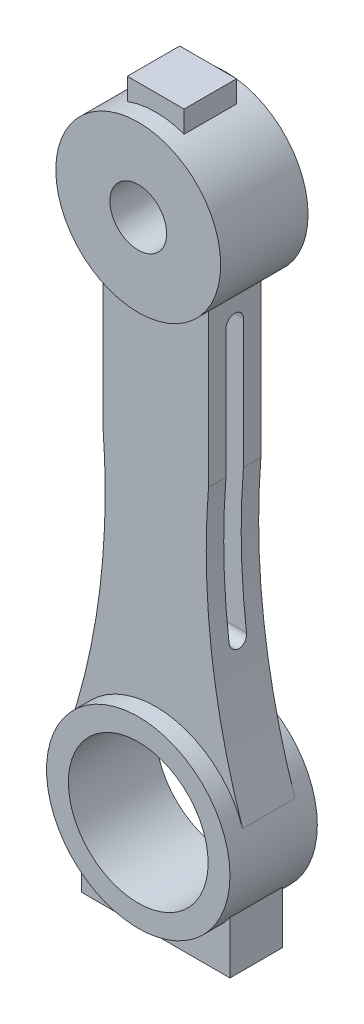
ISO-10303-21;
HEADER;
FILE_DESCRIPTION(('STEP AP214'),'2;1');
FILE_NAME('part.step','',(''),(''),'','','');
FILE_SCHEMA(('AUTOMOTIVE_DESIGN { 1 0 10303 214 1 1 1 1 }'));
ENDSEC;
DATA;
#1=APPLICATION_CONTEXT('core data for automotive mechanical design processes');
#2=APPLICATION_PROTOCOL_DEFINITION('international standard','automotive_design',2000,#1);
#3=PRODUCT_CONTEXT('',#1,'mechanical');
#4=PRODUCT('Part','Part','',(#3));
#5=PRODUCT_RELATED_PRODUCT_CATEGORY('part','',(#4));
#6=PRODUCT_DEFINITION_FORMATION('','',#4);
#7=PRODUCT_DEFINITION_CONTEXT('part definition',#1,'design');
#8=PRODUCT_DEFINITION('design','',#6,#7);
#9=PRODUCT_DEFINITION_SHAPE('','',#8);
#10=(LENGTH_UNIT() NAMED_UNIT(*) SI_UNIT(.MILLI.,.METRE.));
#11=(NAMED_UNIT(*) PLANE_ANGLE_UNIT() SI_UNIT($,.RADIAN.));
#12=(NAMED_UNIT(*) SI_UNIT($,.STERADIAN.) SOLID_ANGLE_UNIT());
#13=UNCERTAINTY_MEASURE_WITH_UNIT(LENGTH_MEASURE(1.E-05),#10,'distance_accuracy_value','');
#14=(GEOMETRIC_REPRESENTATION_CONTEXT(3) GLOBAL_UNCERTAINTY_ASSIGNED_CONTEXT((#13)) GLOBAL_UNIT_ASSIGNED_CONTEXT((#10,
#11,#12)) REPRESENTATION_CONTEXT('',''));
#15=CARTESIAN_POINT('',(0.,0.,0.));
#16=DIRECTION('',(0.,0.,1.));
#17=DIRECTION('',(1.,0.,0.));
#18=AXIS2_PLACEMENT_3D('',#15,#16,#17);
#19=CARTESIAN_POINT('',(171.525621448101,-62.3385849120603,6.));
#20=DIRECTION('',(0.,0.,-1.));
#21=DIRECTION('',(-1.,0.,0.));
#22=AXIS2_PLACEMENT_3D('',#19,#20,#21);
#23=CYLINDRICAL_SURFACE('',#22,159.958297647066);
#24=CARTESIAN_POINT('',(12.7802727197451,-82.,-2.00000000000001));
#25=CARTESIAN_POINT('',(12.7872873414532,-82.0566371139991,-1.99999939400567));
#26=CARTESIAN_POINT('',(12.7943292840255,-82.1132432484063,-1.99759270129749));
#27=CARTESIAN_POINT('',(12.808422755821,-82.2260444921013,-1.98799180149069));
#28=CARTESIAN_POINT('',(12.8154742846555,-82.2822396174989,-1.98079778306532));
#29=CARTESIAN_POINT('',(12.8365567733817,-82.4495350320966,-1.95209830408893));
#30=CARTESIAN_POINT('',(12.8505355662749,-82.5595061994444,-1.9234752615692));
#31=CARTESIAN_POINT('',(12.8779001409659,-82.7730935491784,-1.84802018863842));
#32=CARTESIAN_POINT('',(12.8912856195496,-82.8767064923513,-1.80117896464476));
#33=CARTESIAN_POINT('',(12.9170323970975,-83.0746024326025,-1.69058183530921));
#34=CARTESIAN_POINT('',(12.9293939418516,-83.1688876698105,-1.62683000480176));
#35=CARTESIAN_POINT('',(12.9526447038059,-83.3451536867721,-1.48437492960853));
#36=CARTESIAN_POINT('',(12.9635379615781,-83.4271683054506,-1.40571421204006));
#37=CARTESIAN_POINT('',(12.9835130240159,-83.5768182819943,-1.2355098568575));
#38=CARTESIAN_POINT('',(12.9925946173763,-83.644451962585,-1.14396471857746));
#39=CARTESIAN_POINT('',(13.008549570606,-83.762834333291,-0.951363627936112));
#40=CARTESIAN_POINT('',(13.0154397089814,-83.8137114296629,-0.850387995275236));
#41=CARTESIAN_POINT('',(13.0268516283534,-83.8977769804369,-0.641206380616698));
#42=CARTESIAN_POINT('',(13.0313736785364,-83.9309674453289,-0.533001221994246));
#43=CARTESIAN_POINT('',(13.0378512433228,-83.9784614621124,-0.313383126257495));
#44=CARTESIAN_POINT('',(13.039827567687,-83.9929181571141,-0.20200390512723));
#45=CARTESIAN_POINT('',(13.0412071022917,-84.0030125176839,0.0216208620661234));
#46=CARTESIAN_POINT('',(13.0406103370489,-83.9986503625603,0.133866399864667));
#47=CARTESIAN_POINT('',(13.0368744991897,-83.9712976812293,0.355533997083912));
#48=CARTESIAN_POINT('',(13.0337462213074,-83.9483862516063,0.464966013543431));
#49=CARTESIAN_POINT('',(13.0250785457629,-83.8847193548897,0.678406808177675));
#50=CARTESIAN_POINT('',(13.0195391451696,-83.8439638661038,0.782415579759416));
#51=CARTESIAN_POINT('',(13.0062387701359,-83.7457041164276,0.982317780949797));
#52=CARTESIAN_POINT('',(12.9984730247867,-83.68816388226,1.07819320335089));
#53=CARTESIAN_POINT('',(12.9810041183345,-83.558047589915,1.25892277107229));
#54=CARTESIAN_POINT('',(12.971300987315,-83.4854717652076,1.34377708749308));
#55=CARTESIAN_POINT('',(12.9502183936657,-83.3267951618531,1.50071853901568));
#56=CARTESIAN_POINT('',(12.9388274883789,-83.2406017722705,1.5727104785933));
#57=CARTESIAN_POINT('',(12.9148000977391,-83.0574857036174,1.70124644738217));
#58=CARTESIAN_POINT('',(12.9021631608376,-82.9605591333791,1.7577848481909));
#59=CARTESIAN_POINT('',(12.8759380819939,-82.7578281535156,1.85429852816325));
#60=CARTESIAN_POINT('',(12.8623423609056,-82.6519512814025,1.89411914076092));
#61=CARTESIAN_POINT('',(12.8347356972226,-82.4351431240615,1.95532573401746));
#62=CARTESIAN_POINT('',(12.8207254032024,-82.3242196015561,1.97673908223947));
#63=CARTESIAN_POINT('',(12.8023069085477,-82.1771254709117,1.99245947618217));
#64=CARTESIAN_POINT('',(12.7978868229289,-82.1417293364256,1.99528860685458));
#65=CARTESIAN_POINT('',(12.7890653920062,-82.0708940307434,1.99905631061959));
#66=CARTESIAN_POINT('',(12.7846640277749,-82.0354550284593,1.99999801346112));
#67=CARTESIAN_POINT('',(12.7802727197451,-82.,2.00000000000003));
#68=B_SPLINE_CURVE_WITH_KNOTS('',3,(#24,#25,#26,#27,#28,#29,#30,#31,#32,#33,#34,#35,#36,#37,#38,
#39,#40,#41,#42,#43,#44,#45,#46,#47,#48,#49,#50,#51,#52,#53,#54,#55,#56,#57,#58,#59,#60,#61,#62,
#63,#64,#65,#66,#67),.UNSPECIFIED.,.F.,.F.,(4,2,2,2,2,2,2,2,2,2,2,2,2,2,2,2,2,2,2,2,2,4),(0.,
0.171104435736558,0.342202128476715,0.683917476533051,1.02580549127394,1.36761119829259,
1.70845620237354,2.04934093803694,2.38754915034087,2.72571890934517,3.06110641806035,
3.39649073116875,3.73045240620597,4.06441448722747,4.39909764580796,4.73377560787728,
5.07083627478829,5.40801954098413,5.7482569937137,6.08798770872753,6.19530188632822,
6.30243796692941),.UNSPECIFIED.);
#69=CARTESIAN_POINT('',(12.7802727197451,-82.,-2.00000000000002));
#70=VERTEX_POINT('',#69);
#71=CARTESIAN_POINT('',(12.7802727197451,-82.,2.00000000000003));
#72=VERTEX_POINT('',#71);
#73=EDGE_CURVE('E406',#70,#72,#68,.T.);
#74=ORIENTED_EDGE('',*,*,#73,.T.);
#75=CARTESIAN_POINT('',(171.525621448101,-62.3385849120603,2.00000000000001));
#76=DIRECTION('',(0.,0.,-1.));
#77=DIRECTION('',(0.,1.,0.));
#78=AXIS2_PLACEMENT_3D('',#75,#76,#77);
#79=CIRCLE('',#78,159.958297647066);
#80=CARTESIAN_POINT('',(12.0828581032742,-49.5065077959757,2.00000000000001));
#81=VERTEX_POINT('',#80);
#82=EDGE_CURVE('E259',#72,#81,#79,.T.);
#83=ORIENTED_EDGE('',*,*,#82,.T.);
#84=DIRECTION('',(0.,0.,-1.));
#85=VECTOR('',#84,1.);
#86=CARTESIAN_POINT('',(12.0828581032742,-49.5065077959757,6.));
#87=LINE('',#86,#85);
#88=CARTESIAN_POINT('',(12.0828581032742,-49.5065077959757,6.));
#89=VERTEX_POINT('',#88);
#90=EDGE_CURVE('E371',#89,#81,#87,.T.);
#91=ORIENTED_EDGE('',*,*,#90,.F.);
#92=CARTESIAN_POINT('',(171.525621448101,-62.3385849120603,6.));
#93=DIRECTION('',(0.,0.,1.));
#94=DIRECTION('',(1.,0.,0.));
#95=AXIS2_PLACEMENT_3D('',#92,#93,#94);
#96=CIRCLE('',#95,159.958297647066);
#97=CARTESIAN_POINT('',(19.8882508183088,-113.257783792547,6.));
#98=VERTEX_POINT('',#97);
#99=EDGE_CURVE('E346',#89,#98,#96,.T.);
#100=ORIENTED_EDGE('',*,*,#99,.T.);
#101=DIRECTION('',(0.,0.,-1.));
#102=VECTOR('',#101,1.);
#103=CARTESIAN_POINT('',(19.8882508182896,-113.25778379249,6.));
#104=LINE('',#103,#102);
#105=CARTESIAN_POINT('',(19.8882508183086,-113.257783792547,-6.));
#106=VERTEX_POINT('',#105);
#107=EDGE_CURVE('E374',#98,#106,#104,.T.);
#108=ORIENTED_EDGE('',*,*,#107,.T.);
#109=CARTESIAN_POINT('',(171.525621448101,-62.3385849120603,-6.));
#110=DIRECTION('',(0.,0.,1.));
#111=DIRECTION('',(1.,0.,0.));
#112=AXIS2_PLACEMENT_3D('',#109,#110,#111);
#113=CIRCLE('',#112,159.958297647066);
#114=CARTESIAN_POINT('',(12.0828581032742,-49.5065077959757,-6.));
#115=VERTEX_POINT('',#114);
#116=EDGE_CURVE('E364',#115,#106,#113,.T.);
#117=ORIENTED_EDGE('',*,*,#116,.F.);
#118=CARTESIAN_POINT('',(12.0828581032742,-49.5065077959757,-2.));
#119=VERTEX_POINT('',#118);
#120=EDGE_CURVE('E370',#119,#115,#87,.T.);
#121=ORIENTED_EDGE('',*,*,#120,.F.);
#122=CARTESIAN_POINT('',(171.525621448101,-62.3385849120603,-2.00000000000002));
#123=DIRECTION('',(0.,0.,1.));
#124=DIRECTION('',(0.,-1.,0.));
#125=AXIS2_PLACEMENT_3D('',#122,#123,#124);
#126=CIRCLE('',#125,159.958297647066);
#127=EDGE_CURVE('E64',#119,#70,#126,.T.);
#128=ORIENTED_EDGE('',*,*,#127,.T.);
#129=EDGE_LOOP('',(#74,#83,#91,#100,#108,#117,#121,#128));
#130=FACE_BOUND('',#129,.T.);
#131=ADVANCED_FACE('F41',(#130),#23,.F.);
#132=CARTESIAN_POINT('',(12.0828581032742,0.,6.));
#133=DIRECTION('',(1.,0.,0.));
#134=DIRECTION('',(0.,1.,0.));
#135=AXIS2_PLACEMENT_3D('',#132,#133,#134);
#136=PLANE('',#135);
#137=ORIENTED_EDGE('',*,*,#90,.T.);
#138=DIRECTION('',(0.,1.,0.));
#139=VECTOR('',#138,1.);
#140=CARTESIAN_POINT('',(12.0828581032742,0.,2.));
#141=LINE('',#140,#139);
#142=CARTESIAN_POINT('',(12.0828581032742,-20.,2.));
#143=VERTEX_POINT('',#142);
#144=EDGE_CURVE('E403',#81,#143,#141,.T.);
#145=ORIENTED_EDGE('',*,*,#144,.T.);
#146=CARTESIAN_POINT('',(12.0828581032742,-20.,0.));
#147=DIRECTION('',(1.,0.,0.));
#148=DIRECTION('',(0.,1.,0.));
#149=AXIS2_PLACEMENT_3D('',#146,#147,#148);
#150=CIRCLE('',#149,2.);
#151=CARTESIAN_POINT('',(12.0828581032742,-20.,-2.));
#152=VERTEX_POINT('',#151);
#153=EDGE_CURVE('E400',#143,#152,#150,.F.);
#154=ORIENTED_EDGE('',*,*,#153,.T.);
#155=DIRECTION('',(0.,-1.,0.));
#156=VECTOR('',#155,1.);
#157=CARTESIAN_POINT('',(12.0828581032742,0.,-1.99999999999999));
#158=LINE('',#157,#156);
#159=EDGE_CURVE('E394',#152,#119,#158,.T.);
#160=ORIENTED_EDGE('',*,*,#159,.T.);
#161=ORIENTED_EDGE('',*,*,#120,.T.);
#162=DIRECTION('',(0.,-1.,0.));
#163=VECTOR('',#162,1.);
#164=CARTESIAN_POINT('',(12.0828581032742,0.,-6.));
#165=LINE('',#164,#163);
#166=CARTESIAN_POINT('',(12.0828581032742,-14.5065077959757,-6.));
#167=VERTEX_POINT('',#166);
#168=EDGE_CURVE('E339',#167,#115,#165,.T.);
#169=ORIENTED_EDGE('',*,*,#168,.F.);
#170=DIRECTION('',(0.,0.,-1.));
#171=VECTOR('',#170,1.);
#172=CARTESIAN_POINT('',(12.0828581032742,-14.5065077959757,6.));
#173=LINE('',#172,#171);
#174=CARTESIAN_POINT('',(12.0828581032742,-14.5065077959757,6.));
#175=VERTEX_POINT('',#174);
#176=EDGE_CURVE('E352',#175,#167,#173,.T.);
#177=ORIENTED_EDGE('',*,*,#176,.F.);
#178=DIRECTION('',(0.,-1.,0.));
#179=VECTOR('',#178,1.);
#180=CARTESIAN_POINT('',(12.0828581032742,0.,6.));
#181=LINE('',#180,#179);
#182=EDGE_CURVE('E349',#175,#89,#181,.T.);
#183=ORIENTED_EDGE('',*,*,#182,.T.);
#184=EDGE_LOOP('',(#137,#145,#154,#160,#161,#169,#177,#183));
#185=FACE_BOUND('',#184,.T.);
#186=ADVANCED_FACE('F500',(#185),#136,.T.);
#187=CARTESIAN_POINT('',(0.,0.,10.));
#188=DIRECTION('',(0.,0.,-1.));
#189=DIRECTION('',(-1.,0.,0.));
#190=AXIS2_PLACEMENT_3D('',#187,#188,#189);
#191=CYLINDRICAL_SURFACE('',#190,18.8794657863659);
#192=DIRECTION('',(0.,0.,-1.));
#193=VECTOR('',#192,1.);
#194=CARTESIAN_POINT('',(6.5,17.7252426888481,6.));
#195=LINE('',#194,#193);
#196=CARTESIAN_POINT('',(6.5,17.7252426888481,6.));
#197=VERTEX_POINT('',#196);
#198=CARTESIAN_POINT('',(6.5,17.7252426888481,-6.));
#199=VERTEX_POINT('',#198);
#200=EDGE_CURVE('E320',#197,#199,#195,.T.);
#201=ORIENTED_EDGE('',*,*,#200,.F.);
#202=CARTESIAN_POINT('',(0.,0.,6.));
#203=DIRECTION('',(0.,0.,1.));
#204=DIRECTION('',(1.,0.,0.));
#205=AXIS2_PLACEMENT_3D('',#202,#203,#204);
#206=CIRCLE('',#205,18.8794657863659);
#207=CARTESIAN_POINT('',(-6.5,17.7252426888481,6.));
#208=VERTEX_POINT('',#207);
#209=EDGE_CURVE('E293',#197,#208,#206,.T.);
#210=ORIENTED_EDGE('',*,*,#209,.T.);
#211=DIRECTION('',(0.,0.,-1.));
#212=VECTOR('',#211,1.);
#213=CARTESIAN_POINT('',(-6.5,17.7252426888481,6.));
#214=LINE('',#213,#212);
#215=CARTESIAN_POINT('',(-6.5,17.7252426888481,-6.));
#216=VERTEX_POINT('',#215);
#217=EDGE_CURVE('E304',#208,#216,#214,.T.);
#218=ORIENTED_EDGE('',*,*,#217,.T.);
#219=CARTESIAN_POINT('',(0.,0.,-6.));
#220=DIRECTION('',(0.,0.,1.));
#221=DIRECTION('',(1.,0.,0.));
#222=AXIS2_PLACEMENT_3D('',#219,#220,#221);
#223=CIRCLE('',#222,18.8794657863659);
#224=EDGE_CURVE('E292',#199,#216,#223,.T.);
#225=ORIENTED_EDGE('',*,*,#224,.F.);
#226=EDGE_LOOP('',(#201,#210,#218,#225));
#227=FACE_BOUND('',#226,.T.);
#228=DIRECTION('',(0.,0.,-1.));
#229=VECTOR('',#228,1.);
#230=CARTESIAN_POINT('',(-12.0828581032742,-14.5065077959757,6.));
#231=LINE('',#230,#229);
#232=CARTESIAN_POINT('',(-12.0828581032742,-14.5065077959757,6.));
#233=VERTEX_POINT('',#232);
#234=CARTESIAN_POINT('',(-12.0828581032742,-14.5065077959757,-6.));
#235=VERTEX_POINT('',#234);
#236=EDGE_CURVE('E383',#233,#235,#231,.T.);
#237=ORIENTED_EDGE('',*,*,#236,.F.);
#238=CARTESIAN_POINT('',(0.,0.,6.));
#239=DIRECTION('',(0.,0.,1.));
#240=DIRECTION('',(1.,0.,0.));
#241=AXIS2_PLACEMENT_3D('',#238,#239,#240);
#242=CIRCLE('',#241,18.8794657863659);
#243=EDGE_CURVE('E336',#233,#175,#242,.T.);
#244=ORIENTED_EDGE('',*,*,#243,.T.);
#245=ORIENTED_EDGE('',*,*,#176,.T.);
#246=CARTESIAN_POINT('',(0.,0.,-6.));
#247=DIRECTION('',(0.,0.,1.));
#248=DIRECTION('',(1.,0.,0.));
#249=AXIS2_PLACEMENT_3D('',#246,#247,#248);
#250=CIRCLE('',#249,18.8794657863659);
#251=EDGE_CURVE('E331',#235,#167,#250,.T.);
#252=ORIENTED_EDGE('',*,*,#251,.F.);
#253=EDGE_LOOP('',(#237,#244,#245,#252));
#254=FACE_BOUND('',#253,.T.);
#255=CARTESIAN_POINT('',(0.,0.,10.));
#256=DIRECTION('',(0.,0.,1.));
#257=DIRECTION('',(1.,0.,0.));
#258=AXIS2_PLACEMENT_3D('',#255,#256,#257);
#259=CIRCLE('',#258,18.8794657863659);
#260=CARTESIAN_POINT('',(18.8794657863659,0.,10.));
#261=VERTEX_POINT('',#260);
#262=EDGE_CURVE('E387',#261,#261,#259,.T.);
#263=ORIENTED_EDGE('',*,*,#262,.F.);
#264=EDGE_LOOP('',(#263));
#265=FACE_BOUND('',#264,.T.);
#266=CARTESIAN_POINT('',(0.,0.,-10.));
#267=DIRECTION('',(0.,0.,1.));
#268=DIRECTION('',(1.,0.,0.));
#269=AXIS2_PLACEMENT_3D('',#266,#267,#268);
#270=CIRCLE('',#269,18.8794657863659);
#271=CARTESIAN_POINT('',(18.8794657863659,0.,-10.));
#272=VERTEX_POINT('',#271);
#273=EDGE_CURVE('E386',#272,#272,#270,.T.);
#274=ORIENTED_EDGE('',*,*,#273,.T.);
#275=EDGE_LOOP('',(#274));
#276=FACE_BOUND('',#275,.T.);
#277=ADVANCED_FACE('F43',(#227,#254,#265,#276),#191,.T.);
#278=CARTESIAN_POINT('',(0.,0.,10.));
#279=DIRECTION('',(0.,0.,-1.));
#280=DIRECTION('',(-1.,0.,0.));
#281=AXIS2_PLACEMENT_3D('',#278,#279,#280);
#282=CYLINDRICAL_SURFACE('',#281,6.5);
#283=CARTESIAN_POINT('',(0.,0.,10.));
#284=DIRECTION('',(0.,0.,1.));
#285=DIRECTION('',(1.,0.,0.));
#286=AXIS2_PLACEMENT_3D('',#283,#284,#285);
#287=CIRCLE('',#286,6.5);
#288=CARTESIAN_POINT('',(6.5,0.,10.));
#289=VERTEX_POINT('',#288);
#290=EDGE_CURVE('E390',#289,#289,#287,.T.);
#291=ORIENTED_EDGE('',*,*,#290,.T.);
#292=EDGE_LOOP('',(#291));
#293=FACE_BOUND('',#292,.T.);
#294=CARTESIAN_POINT('',(0.,0.,-10.));
#295=DIRECTION('',(0.,0.,1.));
#296=DIRECTION('',(1.,0.,0.));
#297=AXIS2_PLACEMENT_3D('',#294,#295,#296);
#298=CIRCLE('',#297,6.5);
#299=CARTESIAN_POINT('',(6.5,0.,-10.));
#300=VERTEX_POINT('',#299);
#301=EDGE_CURVE('E391',#300,#300,#298,.T.);
#302=ORIENTED_EDGE('',*,*,#301,.F.);
#303=EDGE_LOOP('',(#302));
#304=FACE_BOUND('',#303,.T.);
#305=ADVANCED_FACE('F507',(#293,#304),#282,.F.);
#306=CARTESIAN_POINT('',(0.,0.,10.));
#307=DIRECTION('',(0.,0.,1.));
#308=DIRECTION('',(1.,0.,0.));
#309=AXIS2_PLACEMENT_3D('',#306,#307,#308);
#310=PLANE('',#309);
#311=ORIENTED_EDGE('',*,*,#262,.T.);
#312=EDGE_LOOP('',(#311));
#313=FACE_BOUND('',#312,.T.);
#314=ORIENTED_EDGE('',*,*,#290,.F.);
#315=EDGE_LOOP('',(#314));
#316=FACE_BOUND('',#315,.T.);
#317=ADVANCED_FACE('F564',(#313,#316),#310,.T.);
#318=CARTESIAN_POINT('',(0.,0.,-10.));
#319=DIRECTION('',(0.,0.,1.));
#320=DIRECTION('',(1.,0.,0.));
#321=AXIS2_PLACEMENT_3D('',#318,#319,#320);
#322=PLANE('',#321);
#323=ORIENTED_EDGE('',*,*,#273,.F.);
#324=EDGE_LOOP('',(#323));
#325=FACE_BOUND('',#324,.T.);
#326=ORIENTED_EDGE('',*,*,#301,.T.);
#327=EDGE_LOOP('',(#326));
#328=FACE_BOUND('',#327,.T.);
#329=ADVANCED_FACE('F562',(#325,#328),#322,.F.);
#330=CARTESIAN_POINT('',(-12.0828581032742,0.,6.));
#331=DIRECTION('',(1.,0.,0.));
#332=DIRECTION('',(0.,1.,0.));
#333=AXIS2_PLACEMENT_3D('',#330,#331,#332);
#334=PLANE('',#333);
#335=DIRECTION('',(0.,0.,-1.));
#336=VECTOR('',#335,1.);
#337=CARTESIAN_POINT('',(-12.0828581032742,-49.5065077959757,6.));
#338=LINE('',#337,#336);
#339=CARTESIAN_POINT('',(-12.0828581032742,-49.5065077959757,-2.00000000000001));
#340=VERTEX_POINT('',#339);
#341=CARTESIAN_POINT('',(-12.0828581032742,-49.5065077959757,-6.));
#342=VERTEX_POINT('',#341);
#343=EDGE_CURVE('E379',#340,#342,#338,.T.);
#344=ORIENTED_EDGE('',*,*,#343,.F.);
#345=DIRECTION('',(0.,1.,0.));
#346=VECTOR('',#345,1.);
#347=CARTESIAN_POINT('',(-12.0828581032742,0.,-1.99999999999999));
#348=LINE('',#347,#346);
#349=CARTESIAN_POINT('',(-12.0828581032742,-20.,-2.));
#350=VERTEX_POINT('',#349);
#351=EDGE_CURVE('E236',#340,#350,#348,.T.);
#352=ORIENTED_EDGE('',*,*,#351,.T.);
#353=CARTESIAN_POINT('',(-12.0828581032742,-20.,0.));
#354=DIRECTION('',(1.,0.,0.));
#355=DIRECTION('',(0.,1.,0.));
#356=AXIS2_PLACEMENT_3D('',#353,#354,#355);
#357=CIRCLE('',#356,2.);
#358=CARTESIAN_POINT('',(-12.0828581032742,-20.,2.));
#359=VERTEX_POINT('',#358);
#360=EDGE_CURVE('E11',#350,#359,#357,.T.);
#361=ORIENTED_EDGE('',*,*,#360,.T.);
#362=DIRECTION('',(0.,-1.,0.));
#363=VECTOR('',#362,1.);
#364=CARTESIAN_POINT('',(-12.0828581032742,0.,2.));
#365=LINE('',#364,#363);
#366=CARTESIAN_POINT('',(-12.0828581032742,-49.5065077959757,2.00000000000001));
#367=VERTEX_POINT('',#366);
#368=EDGE_CURVE('E212',#359,#367,#365,.T.);
#369=ORIENTED_EDGE('',*,*,#368,.T.);
#370=CARTESIAN_POINT('',(-12.0828581032742,-49.5065077959757,6.));
#371=VERTEX_POINT('',#370);
#372=EDGE_CURVE('E380',#371,#367,#338,.T.);
#373=ORIENTED_EDGE('',*,*,#372,.F.);
#374=DIRECTION('',(0.,-1.,0.));
#375=VECTOR('',#374,1.);
#376=CARTESIAN_POINT('',(-12.0828581032742,0.,6.));
#377=LINE('',#376,#375);
#378=EDGE_CURVE('E338',#233,#371,#377,.T.);
#379=ORIENTED_EDGE('',*,*,#378,.F.);
#380=ORIENTED_EDGE('',*,*,#236,.T.);
#381=DIRECTION('',(0.,-1.,0.));
#382=VECTOR('',#381,1.);
#383=CARTESIAN_POINT('',(-12.0828581032742,0.,-6.));
#384=LINE('',#383,#382);
#385=EDGE_CURVE('E355',#235,#342,#384,.T.);
#386=ORIENTED_EDGE('',*,*,#385,.T.);
#387=EDGE_LOOP('',(#344,#352,#361,#369,#373,#379,#380,#386));
#388=FACE_BOUND('',#387,.T.);
#389=ADVANCED_FACE('F558',(#388),#334,.F.);
#390=CARTESIAN_POINT('',(-171.525621448101,-62.3385849120604,6.));
#391=DIRECTION('',(0.,0.,-1.));
#392=DIRECTION('',(-1.,0.,0.));
#393=AXIS2_PLACEMENT_3D('',#390,#391,#392);
#394=CYLINDRICAL_SURFACE('',#393,159.958297647066);
#395=CARTESIAN_POINT('',(-12.7802727197451,-82.,2.00000000000003));
#396=CARTESIAN_POINT('',(-12.7872873414531,-82.0566371139991,1.99999939400569));
#397=CARTESIAN_POINT('',(-12.7943292840254,-82.1132432484064,1.99759270129752));
#398=CARTESIAN_POINT('',(-12.808422755821,-82.2260444921013,1.98799180149071));
#399=CARTESIAN_POINT('',(-12.8154742846555,-82.2822396174989,1.98079778306534));
#400=CARTESIAN_POINT('',(-12.8365567733817,-82.4495350320966,1.95209830408896));
#401=CARTESIAN_POINT('',(-12.8505355662749,-82.5595061994444,1.92347526156923));
#402=CARTESIAN_POINT('',(-12.8779001409659,-82.7730935491784,1.84802018863845));
#403=CARTESIAN_POINT('',(-12.8912856195496,-82.8767064923513,1.80117896464479));
#404=CARTESIAN_POINT('',(-12.9170323970975,-83.0746024326025,1.69058183530923));
#405=CARTESIAN_POINT('',(-12.9293939418515,-83.1688876698105,1.62683000480178));
#406=CARTESIAN_POINT('',(-12.9526447038059,-83.3451536867721,1.48437492960855));
#407=CARTESIAN_POINT('',(-12.963537961578,-83.4271683054506,1.40571421204009));
#408=CARTESIAN_POINT('',(-12.9835130240159,-83.5768182819943,1.23550985685752));
#409=CARTESIAN_POINT('',(-12.9925946173763,-83.644451962585,1.14396471857748));
#410=CARTESIAN_POINT('',(-13.008549570606,-83.762834333291,0.951363627936136));
#411=CARTESIAN_POINT('',(-13.0154397089813,-83.8137114296629,0.850387995275259));
#412=CARTESIAN_POINT('',(-13.0268516283533,-83.8977769804369,0.641206380616721));
#413=CARTESIAN_POINT('',(-13.0313736785364,-83.9309674453289,0.533001221994269));
#414=CARTESIAN_POINT('',(-13.0378512433227,-83.9784614621124,0.313383126257517));
#415=CARTESIAN_POINT('',(-13.039827567687,-83.9929181571141,0.202003905127252));
#416=CARTESIAN_POINT('',(-13.0412071022917,-84.0030125176839,-0.021620862066102));
#417=CARTESIAN_POINT('',(-13.0406103370488,-83.9986503625603,-0.133866399864645));
#418=CARTESIAN_POINT('',(-13.0368744991896,-83.9712976812293,-0.355533997083891));
#419=CARTESIAN_POINT('',(-13.0337462213074,-83.9483862516063,-0.464966013543409));
#420=CARTESIAN_POINT('',(-13.0250785457628,-83.8847193548897,-0.678406808177653));
#421=CARTESIAN_POINT('',(-13.0195391451695,-83.8439638661038,-0.782415579759396));
#422=CARTESIAN_POINT('',(-13.0062387701359,-83.7457041164276,-0.982317780949777));
#423=CARTESIAN_POINT('',(-12.9984730247867,-83.68816388226,-1.07819320335087));
#424=CARTESIAN_POINT('',(-12.9810041183345,-83.558047589915,-1.25892277107227));
#425=CARTESIAN_POINT('',(-12.9713009873149,-83.4854717652076,-1.34377708749306));
#426=CARTESIAN_POINT('',(-12.9502183936657,-83.3267951618531,-1.50071853901566));
#427=CARTESIAN_POINT('',(-12.9388274883789,-83.2406017722705,-1.57271047859328));
#428=CARTESIAN_POINT('',(-12.9148000977391,-83.0574857036174,-1.70124644738214));
#429=CARTESIAN_POINT('',(-12.9021631608375,-82.9605591333791,-1.75778484819088));
#430=CARTESIAN_POINT('',(-12.8759380819938,-82.7578281535156,-1.85429852816323));
#431=CARTESIAN_POINT('',(-12.8623423609056,-82.6519512814025,-1.8941191407609));
#432=CARTESIAN_POINT('',(-12.8347356972226,-82.4351431240615,-1.95532573401744));
#433=CARTESIAN_POINT('',(-12.8207254032024,-82.324219601556,-1.97673908223945));
#434=CARTESIAN_POINT('',(-12.8023069085476,-82.1771254709117,-1.99245947618215));
#435=CARTESIAN_POINT('',(-12.7978868229289,-82.1417293364255,-1.99528860685456));
#436=CARTESIAN_POINT('',(-12.7890653920061,-82.0708940307434,-1.99905631061956));
#437=CARTESIAN_POINT('',(-12.7846640277749,-82.0354550284593,-1.9999980134611));
#438=CARTESIAN_POINT('',(-12.7802727197451,-82.,-2.00000000000001));
#439=B_SPLINE_CURVE_WITH_KNOTS('',3,(#395,#396,#397,#398,#399,#400,#401,#402,#403,#404,#405,
#406,#407,#408,#409,#410,#411,#412,#413,#414,#415,#416,#417,#418,#419,#420,#421,#422,#423,#424,
#425,#426,#427,#428,#429,#430,#431,#432,#433,#434,#435,#436,#437,#438),.UNSPECIFIED.,.F.,.F.,(4,
2,2,2,2,2,2,2,2,2,2,2,2,2,2,2,2,2,2,2,2,4),(0.,0.171104435736572,0.342202128476719,
0.683917476533051,1.02580549127394,1.36761119829259,1.70845620237354,2.04934093803693,
2.38754915034087,2.72571890934517,3.06110641806035,3.39649073116875,3.73045240620597,
4.06441448722747,4.39909764580797,4.73377560787728,5.0708362747883,5.40801954098413,
5.74825699371371,6.08798770872754,6.19530188632824,6.3024379669294),.UNSPECIFIED.);
#440=CARTESIAN_POINT('',(-12.7802727197451,-82.,2.00000000000001));
#441=VERTEX_POINT('',#440);
#442=CARTESIAN_POINT('',(-12.7802727197451,-82.,-2.00000000000002));
#443=VERTEX_POINT('',#442);
#444=EDGE_CURVE('E549',#441,#443,#439,.T.);
#445=ORIENTED_EDGE('',*,*,#444,.T.);
#446=CARTESIAN_POINT('',(-171.525621448101,-62.3385849120604,-2.00000000000002));
#447=DIRECTION('',(0.,0.,-1.));
#448=DIRECTION('',(0.,1.,0.));
#449=AXIS2_PLACEMENT_3D('',#446,#447,#448);
#450=CIRCLE('',#449,159.958297647066);
#451=EDGE_CURVE('E49',#443,#340,#450,.F.);
#452=ORIENTED_EDGE('',*,*,#451,.T.);
#453=ORIENTED_EDGE('',*,*,#343,.T.);
#454=CARTESIAN_POINT('',(-171.525621448101,-62.3385849120604,-6.));
#455=DIRECTION('',(0.,0.,1.));
#456=DIRECTION('',(1.,0.,0.));
#457=AXIS2_PLACEMENT_3D('',#454,#455,#456);
#458=CIRCLE('',#457,159.958297647066);
#459=CARTESIAN_POINT('',(-19.8882508182914,-113.257783792496,-6.));
#460=VERTEX_POINT('',#459);
#461=EDGE_CURVE('E358',#342,#460,#458,.F.);
#462=ORIENTED_EDGE('',*,*,#461,.T.);
#463=DIRECTION('',(0.,0.,-1.));
#464=VECTOR('',#463,1.);
#465=CARTESIAN_POINT('',(-19.8882508182914,-113.257783792496,6.));
#466=LINE('',#465,#464);
#467=CARTESIAN_POINT('',(-19.8882508182879,-113.257783792486,6.));
#468=VERTEX_POINT('',#467);
#469=EDGE_CURVE('E377',#468,#460,#466,.T.);
#470=ORIENTED_EDGE('',*,*,#469,.F.);
#471=CARTESIAN_POINT('',(-171.525621448101,-62.3385849120604,6.));
#472=DIRECTION('',(0.,0.,1.));
#473=DIRECTION('',(1.,0.,0.));
#474=AXIS2_PLACEMENT_3D('',#471,#472,#473);
#475=CIRCLE('',#474,159.958297647066);
#476=EDGE_CURVE('E341',#371,#468,#475,.F.);
#477=ORIENTED_EDGE('',*,*,#476,.F.);
#478=ORIENTED_EDGE('',*,*,#372,.T.);
#479=CARTESIAN_POINT('',(-171.525621448101,-62.3385849120604,2.00000000000001));
#480=DIRECTION('',(0.,0.,1.));
#481=DIRECTION('',(0.,-1.,0.));
#482=AXIS2_PLACEMENT_3D('',#479,#480,#481);
#483=CIRCLE('',#482,159.958297647066);
#484=EDGE_CURVE('E415',#367,#441,#483,.F.);
#485=ORIENTED_EDGE('',*,*,#484,.T.);
#486=EDGE_LOOP('',(#445,#452,#453,#462,#470,#477,#478,#485));
#487=FACE_BOUND('',#486,.T.);
#488=ADVANCED_FACE('F496',(#487),#394,.F.);
#489=CARTESIAN_POINT('',(0.,0.,6.));
#490=DIRECTION('',(0.,0.,1.));
#491=DIRECTION('',(1.,0.,0.));
#492=AXIS2_PLACEMENT_3D('',#489,#490,#491);
#493=PLANE('',#492);
#494=ORIENTED_EDGE('',*,*,#243,.F.);
#495=ORIENTED_EDGE('',*,*,#378,.T.);
#496=ORIENTED_EDGE('',*,*,#476,.T.);
#497=CARTESIAN_POINT('',(0.,-120.,6.));
#498=DIRECTION('',(0.,0.,1.));
#499=DIRECTION('',(1.,0.,0.));
#500=AXIS2_PLACEMENT_3D('',#497,#498,#499);
#501=CIRCLE('',#500,21.);
#502=EDGE_CURVE('E344',#98,#468,#501,.T.);
#503=ORIENTED_EDGE('',*,*,#502,.F.);
#504=ORIENTED_EDGE('',*,*,#99,.F.);
#505=ORIENTED_EDGE('',*,*,#182,.F.);
#506=EDGE_LOOP('',(#494,#495,#496,#503,#504,#505));
#507=FACE_BOUND('',#506,.T.);
#508=ADVANCED_FACE('F493',(#507),#493,.T.);
#509=CARTESIAN_POINT('',(0.,0.,-6.));
#510=DIRECTION('',(0.,0.,1.));
#511=DIRECTION('',(1.,0.,0.));
#512=AXIS2_PLACEMENT_3D('',#509,#510,#511);
#513=PLANE('',#512);
#514=ORIENTED_EDGE('',*,*,#251,.T.);
#515=ORIENTED_EDGE('',*,*,#168,.T.);
#516=ORIENTED_EDGE('',*,*,#116,.T.);
#517=CARTESIAN_POINT('',(0.,-120.,-6.));
#518=DIRECTION('',(0.,0.,1.));
#519=DIRECTION('',(1.,0.,0.));
#520=AXIS2_PLACEMENT_3D('',#517,#518,#519);
#521=CIRCLE('',#520,21.);
#522=EDGE_CURVE('E361',#106,#460,#521,.T.);
#523=ORIENTED_EDGE('',*,*,#522,.T.);
#524=ORIENTED_EDGE('',*,*,#461,.F.);
#525=ORIENTED_EDGE('',*,*,#385,.F.);
#526=EDGE_LOOP('',(#514,#515,#516,#523,#524,#525));
#527=FACE_BOUND('',#526,.T.);
#528=ADVANCED_FACE('F491',(#527),#513,.F.);
#529=CARTESIAN_POINT('',(0.,-120.,10.));
#530=DIRECTION('',(0.,0.,-1.));
#531=DIRECTION('',(-1.,0.,0.));
#532=AXIS2_PLACEMENT_3D('',#529,#530,#531);
#533=CYLINDRICAL_SURFACE('',#532,16.);
#534=CARTESIAN_POINT('',(0.,-120.,10.));
#535=DIRECTION('',(0.,0.,1.));
#536=DIRECTION('',(1.,0.,0.));
#537=AXIS2_PLACEMENT_3D('',#534,#535,#536);
#538=CIRCLE('',#537,16.);
#539=CARTESIAN_POINT('',(16.,-120.,10.));
#540=VERTEX_POINT('',#539);
#541=EDGE_CURVE('E324',#540,#540,#538,.T.);
#542=ORIENTED_EDGE('',*,*,#541,.T.);
#543=EDGE_LOOP('',(#542));
#544=FACE_BOUND('',#543,.T.);
#545=CARTESIAN_POINT('',(0.,-120.,-10.));
#546=DIRECTION('',(0.,0.,1.));
#547=DIRECTION('',(1.,0.,0.));
#548=AXIS2_PLACEMENT_3D('',#545,#546,#547);
#549=CIRCLE('',#548,16.);
#550=CARTESIAN_POINT('',(16.,-120.,-10.));
#551=VERTEX_POINT('',#550);
#552=EDGE_CURVE('E323',#551,#551,#549,.T.);
#553=ORIENTED_EDGE('',*,*,#552,.F.);
#554=EDGE_LOOP('',(#553));
#555=FACE_BOUND('',#554,.T.);
#556=ADVANCED_FACE('F487',(#544,#555),#533,.F.);
#557=CARTESIAN_POINT('',(0.,-120.,10.));
#558=DIRECTION('',(0.,0.,-1.));
#559=DIRECTION('',(-1.,0.,0.));
#560=AXIS2_PLACEMENT_3D('',#557,#558,#559);
#561=CYLINDRICAL_SURFACE('',#560,21.);
#562=DIRECTION('',(0.,0.,-1.));
#563=VECTOR('',#562,1.);
#564=CARTESIAN_POINT('',(-17.,-132.328828005938,6.));
#565=LINE('',#564,#563);
#566=CARTESIAN_POINT('',(-17.,-132.328828005938,6.));
#567=VERTEX_POINT('',#566);
#568=CARTESIAN_POINT('',(-17.,-132.328828005938,-6.));
#569=VERTEX_POINT('',#568);
#570=EDGE_CURVE('E289',#567,#569,#565,.T.);
#571=ORIENTED_EDGE('',*,*,#570,.F.);
#572=CARTESIAN_POINT('',(0.,-120.,6.));
#573=DIRECTION('',(0.,0.,1.));
#574=DIRECTION('',(1.,0.,0.));
#575=AXIS2_PLACEMENT_3D('',#572,#573,#574);
#576=CIRCLE('',#575,21.);
#577=CARTESIAN_POINT('',(17.,-132.328828005938,6.));
#578=VERTEX_POINT('',#577);
#579=EDGE_CURVE('E263',#567,#578,#576,.T.);
#580=ORIENTED_EDGE('',*,*,#579,.T.);
#581=DIRECTION('',(0.,0.,-1.));
#582=VECTOR('',#581,1.);
#583=CARTESIAN_POINT('',(17.,-132.328828005938,6.));
#584=LINE('',#583,#582);
#585=CARTESIAN_POINT('',(17.,-132.328828005938,-6.));
#586=VERTEX_POINT('',#585);
#587=EDGE_CURVE('E273',#578,#586,#584,.T.);
#588=ORIENTED_EDGE('',*,*,#587,.T.);
#589=CARTESIAN_POINT('',(0.,-120.,-6.));
#590=DIRECTION('',(0.,0.,1.));
#591=DIRECTION('',(1.,0.,0.));
#592=AXIS2_PLACEMENT_3D('',#589,#590,#591);
#593=CIRCLE('',#592,21.);
#594=EDGE_CURVE('E262',#569,#586,#593,.T.);
#595=ORIENTED_EDGE('',*,*,#594,.F.);
#596=EDGE_LOOP('',(#571,#580,#588,#595));
#597=FACE_BOUND('',#596,.T.);
#598=ORIENTED_EDGE('',*,*,#502,.T.);
#599=ORIENTED_EDGE('',*,*,#469,.T.);
#600=ORIENTED_EDGE('',*,*,#522,.F.);
#601=ORIENTED_EDGE('',*,*,#107,.F.);
#602=EDGE_LOOP('',(#598,#599,#600,#601));
#603=FACE_BOUND('',#602,.T.);
#604=CARTESIAN_POINT('',(0.,-120.,10.));
#605=DIRECTION('',(0.,0.,1.));
#606=DIRECTION('',(1.,0.,0.));
#607=AXIS2_PLACEMENT_3D('',#604,#605,#606);
#608=CIRCLE('',#607,21.);
#609=CARTESIAN_POINT('',(21.,-120.,10.));
#610=VERTEX_POINT('',#609);
#611=EDGE_CURVE('E327',#610,#610,#608,.T.);
#612=ORIENTED_EDGE('',*,*,#611,.F.);
#613=EDGE_LOOP('',(#612));
#614=FACE_BOUND('',#613,.T.);
#615=CARTESIAN_POINT('',(0.,-120.,-10.));
#616=DIRECTION('',(0.,0.,1.));
#617=DIRECTION('',(1.,0.,0.));
#618=AXIS2_PLACEMENT_3D('',#615,#616,#617);
#619=CIRCLE('',#618,21.);
#620=CARTESIAN_POINT('',(21.,-120.,-10.));
#621=VERTEX_POINT('',#620);
#622=EDGE_CURVE('E328',#621,#621,#619,.T.);
#623=ORIENTED_EDGE('',*,*,#622,.T.);
#624=EDGE_LOOP('',(#623));
#625=FACE_BOUND('',#624,.T.);
#626=ADVANCED_FACE('F480',(#597,#603,#614,#625),#561,.T.);
#627=CARTESIAN_POINT('',(0.,0.,10.));
#628=DIRECTION('',(0.,0.,1.));
#629=DIRECTION('',(1.,0.,0.));
#630=AXIS2_PLACEMENT_3D('',#627,#628,#629);
#631=PLANE('',#630);
#632=ORIENTED_EDGE('',*,*,#541,.F.);
#633=EDGE_LOOP('',(#632));
#634=FACE_BOUND('',#633,.T.);
#635=ORIENTED_EDGE('',*,*,#611,.T.);
#636=EDGE_LOOP('',(#635));
#637=FACE_BOUND('',#636,.T.);
#638=ADVANCED_FACE('F477',(#634,#637),#631,.T.);
#639=CARTESIAN_POINT('',(0.,0.,-10.));
#640=DIRECTION('',(0.,0.,1.));
#641=DIRECTION('',(1.,0.,0.));
#642=AXIS2_PLACEMENT_3D('',#639,#640,#641);
#643=PLANE('',#642);
#644=ORIENTED_EDGE('',*,*,#552,.T.);
#645=EDGE_LOOP('',(#644));
#646=FACE_BOUND('',#645,.T.);
#647=ORIENTED_EDGE('',*,*,#622,.F.);
#648=EDGE_LOOP('',(#647));
#649=FACE_BOUND('',#648,.T.);
#650=ADVANCED_FACE('F475',(#646,#649),#643,.F.);
#651=CARTESIAN_POINT('',(6.49999999999999,0.,6.));
#652=DIRECTION('',(-1.,0.,0.));
#653=DIRECTION('',(0.,-1.,0.));
#654=AXIS2_PLACEMENT_3D('',#651,#652,#653);
#655=PLANE('',#654);
#656=DIRECTION('',(0.,1.,0.));
#657=VECTOR('',#656,1.);
#658=CARTESIAN_POINT('',(6.49999999999999,0.,-6.));
#659=LINE('',#658,#657);
#660=CARTESIAN_POINT('',(6.5,22.7252426888481,-6.));
#661=VERTEX_POINT('',#660);
#662=EDGE_CURVE('E307',#199,#661,#659,.T.);
#663=ORIENTED_EDGE('',*,*,#662,.T.);
#664=DIRECTION('',(0.,0.,-1.));
#665=VECTOR('',#664,1.);
#666=CARTESIAN_POINT('',(6.5,22.7252426888481,6.));
#667=LINE('',#666,#665);
#668=CARTESIAN_POINT('',(6.5,22.7252426888481,6.));
#669=VERTEX_POINT('',#668);
#670=EDGE_CURVE('E318',#669,#661,#667,.T.);
#671=ORIENTED_EDGE('',*,*,#670,.F.);
#672=DIRECTION('',(0.,1.,0.));
#673=VECTOR('',#672,1.);
#674=CARTESIAN_POINT('',(6.49999999999999,0.,6.));
#675=LINE('',#674,#673);
#676=EDGE_CURVE('E295',#197,#669,#675,.T.);
#677=ORIENTED_EDGE('',*,*,#676,.F.);
#678=ORIENTED_EDGE('',*,*,#200,.T.);
#679=EDGE_LOOP('',(#663,#671,#677,#678));
#680=FACE_BOUND('',#679,.T.);
#681=ADVANCED_FACE('F471',(#680),#655,.F.);
#682=CARTESIAN_POINT('',(0.,22.7252426888481,6.));
#683=DIRECTION('',(0.,1.,0.));
#684=DIRECTION('',(0.,0.,1.));
#685=AXIS2_PLACEMENT_3D('',#682,#683,#684);
#686=PLANE('',#685);
#687=DIRECTION('',(1.,0.,0.));
#688=VECTOR('',#687,1.);
#689=CARTESIAN_POINT('',(0.,22.7252426888481,-6.));
#690=LINE('',#689,#688);
#691=CARTESIAN_POINT('',(-6.5,22.7252426888481,-6.));
#692=VERTEX_POINT('',#691);
#693=EDGE_CURVE('E310',#692,#661,#690,.T.);
#694=ORIENTED_EDGE('',*,*,#693,.F.);
#695=DIRECTION('',(0.,0.,-1.));
#696=VECTOR('',#695,1.);
#697=CARTESIAN_POINT('',(-6.5,22.7252426888481,6.));
#698=LINE('',#697,#696);
#699=CARTESIAN_POINT('',(-6.5,22.7252426888481,6.));
#700=VERTEX_POINT('',#699);
#701=EDGE_CURVE('E316',#700,#692,#698,.T.);
#702=ORIENTED_EDGE('',*,*,#701,.F.);
#703=DIRECTION('',(1.,0.,0.));
#704=VECTOR('',#703,1.);
#705=CARTESIAN_POINT('',(0.,22.7252426888481,6.));
#706=LINE('',#705,#704);
#707=EDGE_CURVE('E298',#700,#669,#706,.T.);
#708=ORIENTED_EDGE('',*,*,#707,.T.);
#709=ORIENTED_EDGE('',*,*,#670,.T.);
#710=EDGE_LOOP('',(#694,#702,#708,#709));
#711=FACE_BOUND('',#710,.T.);
#712=ADVANCED_FACE('F467',(#711),#686,.T.);
#713=CARTESIAN_POINT('',(-6.5,0.,6.));
#714=DIRECTION('',(-1.,0.,0.));
#715=DIRECTION('',(0.,-1.,0.));
#716=AXIS2_PLACEMENT_3D('',#713,#714,#715);
#717=PLANE('',#716);
#718=DIRECTION('',(0.,1.,0.));
#719=VECTOR('',#718,1.);
#720=CARTESIAN_POINT('',(-6.5,0.,-6.));
#721=LINE('',#720,#719);
#722=EDGE_CURVE('E296',#216,#692,#721,.T.);
#723=ORIENTED_EDGE('',*,*,#722,.F.);
#724=ORIENTED_EDGE('',*,*,#217,.F.);
#725=DIRECTION('',(0.,1.,0.));
#726=VECTOR('',#725,1.);
#727=CARTESIAN_POINT('',(-6.5,0.,6.));
#728=LINE('',#727,#726);
#729=EDGE_CURVE('E301',#208,#700,#728,.T.);
#730=ORIENTED_EDGE('',*,*,#729,.T.);
#731=ORIENTED_EDGE('',*,*,#701,.T.);
#732=EDGE_LOOP('',(#723,#724,#730,#731));
#733=FACE_BOUND('',#732,.T.);
#734=ADVANCED_FACE('F460',(#733),#717,.T.);
#735=CARTESIAN_POINT('',(0.,0.,6.));
#736=DIRECTION('',(0.,0.,1.));
#737=DIRECTION('',(1.,0.,0.));
#738=AXIS2_PLACEMENT_3D('',#735,#736,#737);
#739=PLANE('',#738);
#740=ORIENTED_EDGE('',*,*,#209,.F.);
#741=ORIENTED_EDGE('',*,*,#676,.T.);
#742=ORIENTED_EDGE('',*,*,#707,.F.);
#743=ORIENTED_EDGE('',*,*,#729,.F.);
#744=EDGE_LOOP('',(#740,#741,#742,#743));
#745=FACE_BOUND('',#744,.T.);
#746=ADVANCED_FACE('F457',(#745),#739,.T.);
#747=CARTESIAN_POINT('',(0.,0.,-6.));
#748=DIRECTION('',(0.,0.,1.));
#749=DIRECTION('',(1.,0.,0.));
#750=AXIS2_PLACEMENT_3D('',#747,#748,#749);
#751=PLANE('',#750);
#752=ORIENTED_EDGE('',*,*,#224,.T.);
#753=ORIENTED_EDGE('',*,*,#722,.T.);
#754=ORIENTED_EDGE('',*,*,#693,.T.);
#755=ORIENTED_EDGE('',*,*,#662,.F.);
#756=EDGE_LOOP('',(#752,#753,#754,#755));
#757=FACE_BOUND('',#756,.T.);
#758=ADVANCED_FACE('F455',(#757),#751,.F.);
#759=CARTESIAN_POINT('',(-17.,0.,6.));
#760=DIRECTION('',(1.,0.,0.));
#761=DIRECTION('',(0.,0.,-1.));
#762=AXIS2_PLACEMENT_3D('',#759,#760,#761);
#763=PLANE('',#762);
#764=DIRECTION('',(0.,-1.,0.));
#765=VECTOR('',#764,1.);
#766=CARTESIAN_POINT('',(-17.,0.,-6.));
#767=LINE('',#766,#765);
#768=CARTESIAN_POINT('',(-17.,-144.328828005938,-6.));
#769=VERTEX_POINT('',#768);
#770=EDGE_CURVE('E276',#569,#769,#767,.T.);
#771=ORIENTED_EDGE('',*,*,#770,.T.);
#772=DIRECTION('',(0.,0.,-1.));
#773=VECTOR('',#772,1.);
#774=CARTESIAN_POINT('',(-17.,-144.328828005938,6.));
#775=LINE('',#774,#773);
#776=CARTESIAN_POINT('',(-17.,-144.328828005938,6.));
#777=VERTEX_POINT('',#776);
#778=EDGE_CURVE('E286',#777,#769,#775,.T.);
#779=ORIENTED_EDGE('',*,*,#778,.F.);
#780=DIRECTION('',(0.,-1.,0.));
#781=VECTOR('',#780,1.);
#782=CARTESIAN_POINT('',(-17.,0.,6.));
#783=LINE('',#782,#781);
#784=EDGE_CURVE('E265',#567,#777,#783,.T.);
#785=ORIENTED_EDGE('',*,*,#784,.F.);
#786=ORIENTED_EDGE('',*,*,#570,.T.);
#787=EDGE_LOOP('',(#771,#779,#785,#786));
#788=FACE_BOUND('',#787,.T.);
#789=ADVANCED_FACE('F451',(#788),#763,.F.);
#790=CARTESIAN_POINT('',(0.,-144.328828005938,6.));
#791=DIRECTION('',(0.,1.,0.));
#792=DIRECTION('',(0.,0.,1.));
#793=AXIS2_PLACEMENT_3D('',#790,#791,#792);
#794=PLANE('',#793);
#795=DIRECTION('',(1.,0.,0.));
#796=VECTOR('',#795,1.);
#797=CARTESIAN_POINT('',(0.,-144.328828005938,-6.));
#798=LINE('',#797,#796);
#799=CARTESIAN_POINT('',(17.,-144.328828005938,-6.));
#800=VERTEX_POINT('',#799);
#801=EDGE_CURVE('E278',#769,#800,#798,.T.);
#802=ORIENTED_EDGE('',*,*,#801,.T.);
#803=DIRECTION('',(0.,0.,-1.));
#804=VECTOR('',#803,1.);
#805=CARTESIAN_POINT('',(17.,-144.328828005938,6.));
#806=LINE('',#805,#804);
#807=CARTESIAN_POINT('',(17.,-144.328828005938,6.));
#808=VERTEX_POINT('',#807);
#809=EDGE_CURVE('E284',#808,#800,#806,.T.);
#810=ORIENTED_EDGE('',*,*,#809,.F.);
#811=DIRECTION('',(1.,0.,0.));
#812=VECTOR('',#811,1.);
#813=CARTESIAN_POINT('',(0.,-144.328828005938,6.));
#814=LINE('',#813,#812);
#815=EDGE_CURVE('E268',#777,#808,#814,.T.);
#816=ORIENTED_EDGE('',*,*,#815,.F.);
#817=ORIENTED_EDGE('',*,*,#778,.T.);
#818=EDGE_LOOP('',(#802,#810,#816,#817));
#819=FACE_BOUND('',#818,.T.);
#820=ADVANCED_FACE('F447',(#819),#794,.F.);
#821=CARTESIAN_POINT('',(17.,0.,6.));
#822=DIRECTION('',(1.,0.,0.));
#823=DIRECTION('',(0.,0.,-1.));
#824=AXIS2_PLACEMENT_3D('',#821,#822,#823);
#825=PLANE('',#824);
#826=DIRECTION('',(0.,-1.,0.));
#827=VECTOR('',#826,1.);
#828=CARTESIAN_POINT('',(17.,0.,-6.));
#829=LINE('',#828,#827);
#830=EDGE_CURVE('E266',#586,#800,#829,.T.);
#831=ORIENTED_EDGE('',*,*,#830,.F.);
#832=ORIENTED_EDGE('',*,*,#587,.F.);
#833=DIRECTION('',(0.,-1.,0.));
#834=VECTOR('',#833,1.);
#835=CARTESIAN_POINT('',(17.,0.,6.));
#836=LINE('',#835,#834);
#837=EDGE_CURVE('E270',#578,#808,#836,.T.);
#838=ORIENTED_EDGE('',*,*,#837,.T.);
#839=ORIENTED_EDGE('',*,*,#809,.T.);
#840=EDGE_LOOP('',(#831,#832,#838,#839));
#841=FACE_BOUND('',#840,.T.);
#842=ADVANCED_FACE('F440',(#841),#825,.T.);
#843=CARTESIAN_POINT('',(0.,0.,6.));
#844=DIRECTION('',(0.,0.,1.));
#845=DIRECTION('',(1.,0.,0.));
#846=AXIS2_PLACEMENT_3D('',#843,#844,#845);
#847=PLANE('',#846);
#848=ORIENTED_EDGE('',*,*,#579,.F.);
#849=ORIENTED_EDGE('',*,*,#784,.T.);
#850=ORIENTED_EDGE('',*,*,#815,.T.);
#851=ORIENTED_EDGE('',*,*,#837,.F.);
#852=EDGE_LOOP('',(#848,#849,#850,#851));
#853=FACE_BOUND('',#852,.T.);
#854=ADVANCED_FACE('F437',(#853),#847,.T.);
#855=CARTESIAN_POINT('',(0.,0.,-6.));
#856=DIRECTION('',(0.,0.,1.));
#857=DIRECTION('',(1.,0.,0.));
#858=AXIS2_PLACEMENT_3D('',#855,#856,#857);
#859=PLANE('',#858);
#860=ORIENTED_EDGE('',*,*,#594,.T.);
#861=ORIENTED_EDGE('',*,*,#830,.T.);
#862=ORIENTED_EDGE('',*,*,#801,.F.);
#863=ORIENTED_EDGE('',*,*,#770,.F.);
#864=EDGE_LOOP('',(#860,#861,#862,#863));
#865=FACE_BOUND('',#864,.T.);
#866=ADVANCED_FACE('F435',(#865),#859,.F.);
#867=CARTESIAN_POINT('',(21.,-20.,0.));
#868=DIRECTION('',(-1.,0.,0.));
#869=DIRECTION('',(0.,0.,1.));
#870=AXIS2_PLACEMENT_3D('',#867,#868,#869);
#871=CYLINDRICAL_SURFACE('',#870,2.);
#872=DIRECTION('',(-1.,0.,0.));
#873=VECTOR('',#872,1.);
#874=CARTESIAN_POINT('',(21.,-20.,2.));
#875=LINE('',#874,#873);
#876=CARTESIAN_POINT('',(6.,-20.,2.));
#877=VERTEX_POINT('',#876);
#878=EDGE_CURVE('E256',#143,#877,#875,.T.);
#879=ORIENTED_EDGE('',*,*,#878,.T.);
#880=CARTESIAN_POINT('',(6.,-20.,0.));
#881=DIRECTION('',(1.,0.,0.));
#882=DIRECTION('',(0.,0.,-1.));
#883=AXIS2_PLACEMENT_3D('',#880,#881,#882);
#884=CIRCLE('',#883,2.);
#885=CARTESIAN_POINT('',(6.,-20.,-2.));
#886=VERTEX_POINT('',#885);
#887=EDGE_CURVE('E238',#886,#877,#884,.T.);
#888=ORIENTED_EDGE('',*,*,#887,.F.);
#889=DIRECTION('',(-1.,0.,0.));
#890=VECTOR('',#889,1.);
#891=CARTESIAN_POINT('',(21.,-20.,-2.));
#892=LINE('',#891,#890);
#893=EDGE_CURVE('E250',#152,#886,#892,.T.);
#894=ORIENTED_EDGE('',*,*,#893,.F.);
#895=ORIENTED_EDGE('',*,*,#153,.F.);
#896=EDGE_LOOP('',(#879,#888,#894,#895));
#897=FACE_BOUND('',#896,.T.);
#898=ADVANCED_FACE('F431',(#897),#871,.F.);
#899=CARTESIAN_POINT('',(21.,-20.,2.));
#900=DIRECTION('',(0.,0.,-1.));
#901=DIRECTION('',(0.,1.,0.));
#902=AXIS2_PLACEMENT_3D('',#899,#900,#901);
#903=PLANE('',#902);
#904=DIRECTION('',(-1.,0.,0.));
#905=VECTOR('',#904,1.);
#906=CARTESIAN_POINT('',(21.,-82.,2.00000000000003));
#907=LINE('',#906,#905);
#908=CARTESIAN_POINT('',(6.,-82.,2.00000000000003));
#909=VERTEX_POINT('',#908);
#910=EDGE_CURVE('E254',#72,#909,#907,.T.);
#911=ORIENTED_EDGE('',*,*,#910,.T.);
#912=DIRECTION('',(0.,-1.,0.));
#913=VECTOR('',#912,1.);
#914=CARTESIAN_POINT('',(6.,-20.,2.));
#915=LINE('',#914,#913);
#916=EDGE_CURVE('E241',#877,#909,#915,.T.);
#917=ORIENTED_EDGE('',*,*,#916,.F.);
#918=ORIENTED_EDGE('',*,*,#878,.F.);
#919=ORIENTED_EDGE('',*,*,#144,.F.);
#920=ORIENTED_EDGE('',*,*,#82,.F.);
#921=EDGE_LOOP('',(#911,#917,#918,#919,#920));
#922=FACE_BOUND('',#921,.T.);
#923=ADVANCED_FACE('F426',(#922),#903,.T.);
#924=CARTESIAN_POINT('',(21.,-82.,0.));
#925=DIRECTION('',(-1.,0.,0.));
#926=DIRECTION('',(0.,0.,1.));
#927=AXIS2_PLACEMENT_3D('',#924,#925,#926);
#928=CYLINDRICAL_SURFACE('',#927,2.00000000000002);
#929=DIRECTION('',(-1.,0.,0.));
#930=VECTOR('',#929,1.);
#931=CARTESIAN_POINT('',(21.,-82.,-2.00000000000002));
#932=LINE('',#931,#930);
#933=CARTESIAN_POINT('',(6.,-82.,-2.00000000000002));
#934=VERTEX_POINT('',#933);
#935=EDGE_CURVE('E252',#70,#934,#932,.T.);
#936=ORIENTED_EDGE('',*,*,#935,.T.);
#937=CARTESIAN_POINT('',(6.,-82.,0.));
#938=DIRECTION('',(1.,0.,0.));
#939=DIRECTION('',(0.,0.,-1.));
#940=AXIS2_PLACEMENT_3D('',#937,#938,#939);
#941=CIRCLE('',#940,2.00000000000002);
#942=EDGE_CURVE('E244',#909,#934,#941,.T.);
#943=ORIENTED_EDGE('',*,*,#942,.F.);
#944=ORIENTED_EDGE('',*,*,#910,.F.);
#945=ORIENTED_EDGE('',*,*,#73,.F.);
#946=EDGE_LOOP('',(#936,#943,#944,#945));
#947=FACE_BOUND('',#946,.T.);
#948=ADVANCED_FACE('F420',(#947),#928,.F.);
#949=CARTESIAN_POINT('',(21.,-20.,-2.));
#950=DIRECTION('',(0.,0.,1.));
#951=DIRECTION('',(0.,-1.,0.));
#952=AXIS2_PLACEMENT_3D('',#949,#950,#951);
#953=PLANE('',#952);
#954=ORIENTED_EDGE('',*,*,#159,.F.);
#955=ORIENTED_EDGE('',*,*,#893,.T.);
#956=DIRECTION('',(0.,1.,0.));
#957=VECTOR('',#956,1.);
#958=CARTESIAN_POINT('',(6.,-20.,-2.));
#959=LINE('',#958,#957);
#960=EDGE_CURVE('E247',#934,#886,#959,.T.);
#961=ORIENTED_EDGE('',*,*,#960,.F.);
#962=ORIENTED_EDGE('',*,*,#935,.F.);
#963=ORIENTED_EDGE('',*,*,#127,.F.);
#964=EDGE_LOOP('',(#954,#955,#961,#962,#963));
#965=FACE_BOUND('',#964,.T.);
#966=ADVANCED_FACE('F425',(#965),#953,.T.);
#967=CARTESIAN_POINT('',(6.,-20.,0.));
#968=DIRECTION('',(1.,0.,0.));
#969=DIRECTION('',(0.,0.,-1.));
#970=AXIS2_PLACEMENT_3D('',#967,#968,#969);
#971=PLANE('',#970);
#972=ORIENTED_EDGE('',*,*,#887,.T.);
#973=ORIENTED_EDGE('',*,*,#916,.T.);
#974=ORIENTED_EDGE('',*,*,#942,.T.);
#975=ORIENTED_EDGE('',*,*,#960,.T.);
#976=EDGE_LOOP('',(#972,#973,#974,#975));
#977=FACE_BOUND('',#976,.T.);
#978=ADVANCED_FACE('F530',(#977),#971,.T.);
#979=CARTESIAN_POINT('',(-21.,-20.,0.));
#980=DIRECTION('',(1.,0.,0.));
#981=DIRECTION('',(0.,0.,-1.));
#982=AXIS2_PLACEMENT_3D('',#979,#980,#981);
#983=CYLINDRICAL_SURFACE('',#982,2.);
#984=DIRECTION('',(1.,0.,0.));
#985=VECTOR('',#984,1.);
#986=CARTESIAN_POINT('',(-21.,-20.,-2.));
#987=LINE('',#986,#985);
#988=CARTESIAN_POINT('',(-6.,-20.,-2.));
#989=VERTEX_POINT('',#988);
#990=EDGE_CURVE('E203',#350,#989,#987,.T.);
#991=ORIENTED_EDGE('',*,*,#990,.T.);
#992=CARTESIAN_POINT('',(-6.,-20.,0.));
#993=DIRECTION('',(1.,0.,0.));
#994=DIRECTION('',(0.,0.,-1.));
#995=AXIS2_PLACEMENT_3D('',#992,#993,#994);
#996=CIRCLE('',#995,2.);
#997=CARTESIAN_POINT('',(-6.,-20.,2.));
#998=VERTEX_POINT('',#997);
#999=EDGE_CURVE('E207',#989,#998,#996,.T.);
#1000=ORIENTED_EDGE('',*,*,#999,.T.);
#1001=DIRECTION('',(1.,0.,0.));
#1002=VECTOR('',#1001,1.);
#1003=CARTESIAN_POINT('',(-21.,-20.,2.));
#1004=LINE('',#1003,#1002);
#1005=EDGE_CURVE('E230',#359,#998,#1004,.T.);
#1006=ORIENTED_EDGE('',*,*,#1005,.F.);
#1007=ORIENTED_EDGE('',*,*,#360,.F.);
#1008=EDGE_LOOP('',(#991,#1000,#1006,#1007));
#1009=FACE_BOUND('',#1008,.T.);
#1010=ADVANCED_FACE('F205',(#1009),#983,.F.);
#1011=CARTESIAN_POINT('',(-21.,-20.,-2.));
#1012=DIRECTION('',(0.,0.,-1.));
#1013=DIRECTION('',(0.,1.,0.));
#1014=AXIS2_PLACEMENT_3D('',#1011,#1012,#1013);
#1015=PLANE('',#1014);
#1016=ORIENTED_EDGE('',*,*,#451,.F.);
#1017=DIRECTION('',(1.,0.,0.));
#1018=VECTOR('',#1017,1.);
#1019=CARTESIAN_POINT('',(-21.,-82.,-2.00000000000002));
#1020=LINE('',#1019,#1018);
#1021=CARTESIAN_POINT('',(-6.,-82.,-2.00000000000002));
#1022=VERTEX_POINT('',#1021);
#1023=EDGE_CURVE('E213',#443,#1022,#1020,.T.);
#1024=ORIENTED_EDGE('',*,*,#1023,.T.);
#1025=DIRECTION('',(0.,1.,0.));
#1026=VECTOR('',#1025,1.);
#1027=CARTESIAN_POINT('',(-6.,-20.,-2.));
#1028=LINE('',#1027,#1026);
#1029=EDGE_CURVE('E219',#1022,#989,#1028,.T.);
#1030=ORIENTED_EDGE('',*,*,#1029,.T.);
#1031=ORIENTED_EDGE('',*,*,#990,.F.);
#1032=ORIENTED_EDGE('',*,*,#351,.F.);
#1033=EDGE_LOOP('',(#1016,#1024,#1030,#1031,#1032));
#1034=FACE_BOUND('',#1033,.T.);
#1035=ADVANCED_FACE('F223',(#1034),#1015,.F.);
#1036=CARTESIAN_POINT('',(-21.,-82.,0.));
#1037=DIRECTION('',(1.,0.,0.));
#1038=DIRECTION('',(0.,0.,-1.));
#1039=AXIS2_PLACEMENT_3D('',#1036,#1037,#1038);
#1040=CYLINDRICAL_SURFACE('',#1039,2.00000000000002);
#1041=DIRECTION('',(1.,0.,0.));
#1042=VECTOR('',#1041,1.);
#1043=CARTESIAN_POINT('',(-21.,-82.,2.00000000000003));
#1044=LINE('',#1043,#1042);
#1045=CARTESIAN_POINT('',(-6.,-82.,2.00000000000003));
#1046=VERTEX_POINT('',#1045);
#1047=EDGE_CURVE('E56',#441,#1046,#1044,.T.);
#1048=ORIENTED_EDGE('',*,*,#1047,.T.);
#1049=CARTESIAN_POINT('',(-6.,-82.,0.));
#1050=DIRECTION('',(1.,0.,0.));
#1051=DIRECTION('',(0.,0.,-1.));
#1052=AXIS2_PLACEMENT_3D('',#1049,#1050,#1051);
#1053=CIRCLE('',#1052,2.00000000000002);
#1054=EDGE_CURVE('E225',#1046,#1022,#1053,.T.);
#1055=ORIENTED_EDGE('',*,*,#1054,.T.);
#1056=ORIENTED_EDGE('',*,*,#1023,.F.);
#1057=ORIENTED_EDGE('',*,*,#444,.F.);
#1058=EDGE_LOOP('',(#1048,#1055,#1056,#1057));
#1059=FACE_BOUND('',#1058,.T.);
#1060=ADVANCED_FACE('F542',(#1059),#1040,.F.);
#1061=CARTESIAN_POINT('',(-21.,-20.,2.));
#1062=DIRECTION('',(0.,0.,1.));
#1063=DIRECTION('',(0.,-1.,0.));
#1064=AXIS2_PLACEMENT_3D('',#1061,#1062,#1063);
#1065=PLANE('',#1064);
#1066=ORIENTED_EDGE('',*,*,#1005,.T.);
#1067=DIRECTION('',(0.,-1.,0.));
#1068=VECTOR('',#1067,1.);
#1069=CARTESIAN_POINT('',(-6.,-20.,2.));
#1070=LINE('',#1069,#1068);
#1071=EDGE_CURVE('E221',#998,#1046,#1070,.T.);
#1072=ORIENTED_EDGE('',*,*,#1071,.T.);
#1073=ORIENTED_EDGE('',*,*,#1047,.F.);
#1074=ORIENTED_EDGE('',*,*,#484,.F.);
#1075=ORIENTED_EDGE('',*,*,#368,.F.);
#1076=EDGE_LOOP('',(#1066,#1072,#1073,#1074,#1075));
#1077=FACE_BOUND('',#1076,.T.);
#1078=ADVANCED_FACE('F546',(#1077),#1065,.F.);
#1079=CARTESIAN_POINT('',(-6.,-20.,0.));
#1080=DIRECTION('',(-1.,0.,0.));
#1081=DIRECTION('',(0.,0.,-1.));
#1082=AXIS2_PLACEMENT_3D('',#1079,#1080,#1081);
#1083=PLANE('',#1082);
#1084=ORIENTED_EDGE('',*,*,#999,.F.);
#1085=ORIENTED_EDGE('',*,*,#1029,.F.);
#1086=ORIENTED_EDGE('',*,*,#1054,.F.);
#1087=ORIENTED_EDGE('',*,*,#1071,.F.);
#1088=EDGE_LOOP('',(#1084,#1085,#1086,#1087));
#1089=FACE_BOUND('',#1088,.T.);
#1090=ADVANCED_FACE('F217',(#1089),#1083,.T.);
#1091=CLOSED_SHELL('',(#131,#186,#277,#305,#317,#329,#389,#488,#508,#528,#556,#626,#638,#650,
#681,#712,#734,#746,#758,#789,#820,#842,#854,#866,#898,#923,#948,#966,#978,#1010,#1035,#1060,
#1078,#1090));
#1092=MANIFOLD_SOLID_BREP('B2',#1091);
#1093=ADVANCED_BREP_SHAPE_REPRESENTATION('',(#18,#1092),#14);
#1094=SHAPE_DEFINITION_REPRESENTATION(#9,#1093);
ENDSEC;
END-ISO-10303-21;
